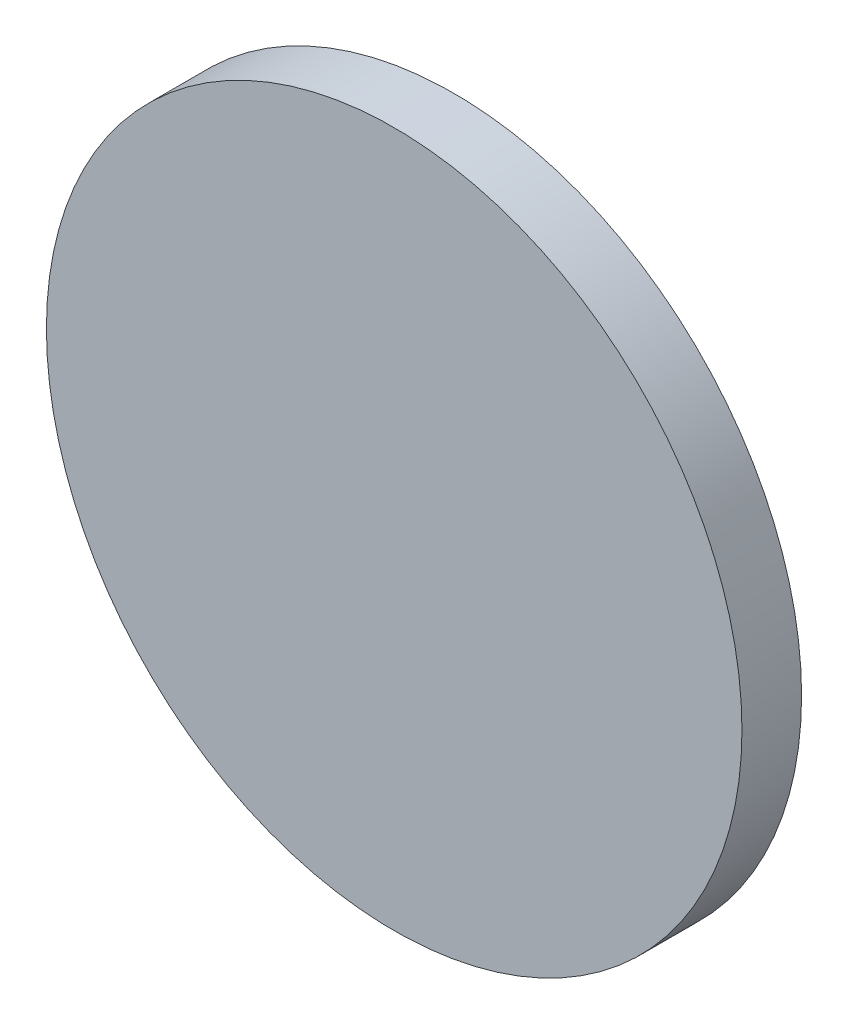
ISO-10303-21;
HEADER;
FILE_DESCRIPTION(('STEP AP214'),'2;1');
FILE_NAME('part.step','',(''),(''),'','','');
FILE_SCHEMA(('AUTOMOTIVE_DESIGN { 1 0 10303 214 1 1 1 1 }'));
ENDSEC;
DATA;
#1=APPLICATION_CONTEXT('core data for automotive mechanical design processes');
#2=APPLICATION_PROTOCOL_DEFINITION('international standard','automotive_design',2000,#1);
#3=PRODUCT_CONTEXT('',#1,'mechanical');
#4=PRODUCT('Part','Part','',(#3));
#5=PRODUCT_RELATED_PRODUCT_CATEGORY('part','',(#4));
#6=PRODUCT_DEFINITION_FORMATION('','',#4);
#7=PRODUCT_DEFINITION_CONTEXT('part definition',#1,'design');
#8=PRODUCT_DEFINITION('design','',#6,#7);
#9=PRODUCT_DEFINITION_SHAPE('','',#8);
#10=(LENGTH_UNIT() NAMED_UNIT(*) SI_UNIT(.MILLI.,.METRE.));
#11=(NAMED_UNIT(*) PLANE_ANGLE_UNIT() SI_UNIT($,.RADIAN.));
#12=(NAMED_UNIT(*) SI_UNIT($,.STERADIAN.) SOLID_ANGLE_UNIT());
#13=UNCERTAINTY_MEASURE_WITH_UNIT(LENGTH_MEASURE(1.E-05),#10,'distance_accuracy_value','');
#14=(GEOMETRIC_REPRESENTATION_CONTEXT(3) GLOBAL_UNCERTAINTY_ASSIGNED_CONTEXT((#13)) GLOBAL_UNIT_ASSIGNED_CONTEXT((#10,
#11,#12)) REPRESENTATION_CONTEXT('',''));
#15=CARTESIAN_POINT('',(0.,0.,0.));
#16=DIRECTION('',(0.,0.,1.));
#17=DIRECTION('',(1.,0.,0.));
#18=AXIS2_PLACEMENT_3D('',#15,#16,#17);
#19=CARTESIAN_POINT('',(11.527,6.787000014875,0.76487));
#20=DIRECTION('',(0.,0.,-1.));
#21=DIRECTION('',(-1.,0.,0.));
#22=AXIS2_PLACEMENT_3D('',#19,#20,#21);
#23=PLANE('',#22);
#24=CARTESIAN_POINT('',(11.527,6.787000014875,0.76487));
#25=DIRECTION('',(0.,0.,1.));
#26=DIRECTION('',(1.,0.,0.));
#27=AXIS2_PLACEMENT_3D('',#24,#25,#26);
#28=CIRCLE('',#27,0.200024667);
#29=CARTESIAN_POINT('',(11.727024667,6.787000014875,0.76487));
#30=VERTEX_POINT('',#29);
#31=EDGE_CURVE('E18',#30,#30,#28,.T.);
#32=ORIENTED_EDGE('',*,*,#31,.F.);
#33=EDGE_LOOP('',(#32));
#34=FACE_BOUND('',#33,.T.);
#35=ADVANCED_FACE('F15',(#34),#23,.T.);
#36=CARTESIAN_POINT('',(11.527,6.787000014875,0.76487));
#37=DIRECTION('',(0.,0.,1.));
#38=DIRECTION('',(1.,0.,0.));
#39=AXIS2_PLACEMENT_3D('',#36,#37,#38);
#40=CYLINDRICAL_SURFACE('',#39,0.200024667);
#41=CARTESIAN_POINT('',(11.527,6.787000014875,0.79916));
#42=DIRECTION('',(0.,0.,1.));
#43=DIRECTION('',(1.,0.,0.));
#44=AXIS2_PLACEMENT_3D('',#41,#42,#43);
#45=CIRCLE('',#44,0.200024667);
#46=CARTESIAN_POINT('',(11.727024667,6.787000014875,0.79916));
#47=VERTEX_POINT('',#46);
#48=EDGE_CURVE('E10',#47,#47,#45,.T.);
#49=ORIENTED_EDGE('',*,*,#48,.F.);
#50=EDGE_LOOP('',(#49));
#51=FACE_BOUND('',#50,.T.);
#52=ORIENTED_EDGE('',*,*,#31,.T.);
#53=EDGE_LOOP('',(#52));
#54=FACE_BOUND('',#53,.T.);
#55=ADVANCED_FACE('F27',(#51,#54),#40,.T.);
#56=CARTESIAN_POINT('',(11.527,6.787000014875,0.79916));
#57=DIRECTION('',(0.,0.,1.));
#58=DIRECTION('',(1.,0.,0.));
#59=AXIS2_PLACEMENT_3D('',#56,#57,#58);
#60=PLANE('',#59);
#61=ORIENTED_EDGE('',*,*,#48,.T.);
#62=EDGE_LOOP('',(#61));
#63=FACE_BOUND('',#62,.T.);
#64=ADVANCED_FACE('F34',(#63),#60,.T.);
#65=CLOSED_SHELL('',(#35,#55,#64));
#66=MANIFOLD_SOLID_BREP('B1',#65);
#67=ADVANCED_BREP_SHAPE_REPRESENTATION('',(#18,#66),#14);
#68=SHAPE_DEFINITION_REPRESENTATION(#9,#67);
ENDSEC;
END-ISO-10303-21;
